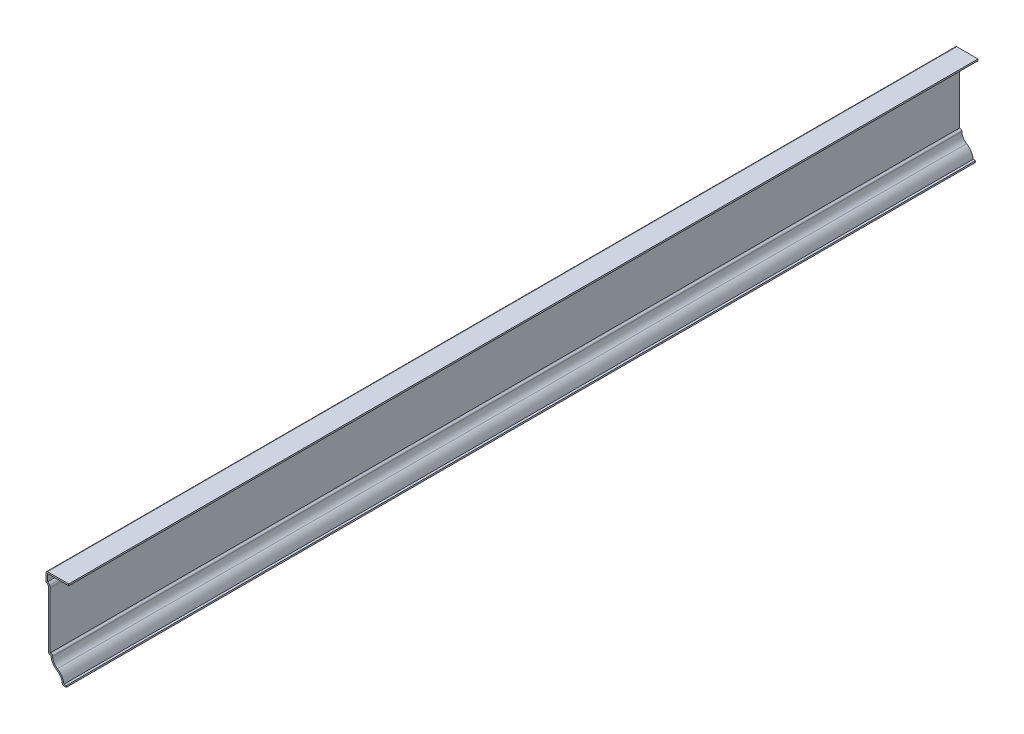
ISO-10303-21;
HEADER;
FILE_DESCRIPTION(('STEP AP214'),'2;1');
FILE_NAME('part.step','',(''),(''),'','','');
FILE_SCHEMA(('AUTOMOTIVE_DESIGN { 1 0 10303 214 1 1 1 1 }'));
ENDSEC;
DATA;
#1=APPLICATION_CONTEXT('core data for automotive mechanical design processes');
#2=APPLICATION_PROTOCOL_DEFINITION('international standard','automotive_design',2000,#1);
#3=PRODUCT_CONTEXT('',#1,'mechanical');
#4=PRODUCT('Part','Part','',(#3));
#5=PRODUCT_RELATED_PRODUCT_CATEGORY('part','',(#4));
#6=PRODUCT_DEFINITION_FORMATION('','',#4);
#7=PRODUCT_DEFINITION_CONTEXT('part definition',#1,'design');
#8=PRODUCT_DEFINITION('design','',#6,#7);
#9=PRODUCT_DEFINITION_SHAPE('','',#8);
#10=(LENGTH_UNIT() NAMED_UNIT(*) SI_UNIT(.MILLI.,.METRE.));
#11=(NAMED_UNIT(*) PLANE_ANGLE_UNIT() SI_UNIT($,.RADIAN.));
#12=(NAMED_UNIT(*) SI_UNIT($,.STERADIAN.) SOLID_ANGLE_UNIT());
#13=UNCERTAINTY_MEASURE_WITH_UNIT(LENGTH_MEASURE(1.E-05),#10,'distance_accuracy_value','');
#14=(GEOMETRIC_REPRESENTATION_CONTEXT(3) GLOBAL_UNCERTAINTY_ASSIGNED_CONTEXT((#13)) GLOBAL_UNIT_ASSIGNED_CONTEXT((#10,
#11,#12)) REPRESENTATION_CONTEXT('',''));
#15=CARTESIAN_POINT('',(0.,0.,0.));
#16=DIRECTION('',(0.,0.,1.));
#17=DIRECTION('',(1.,0.,0.));
#18=AXIS2_PLACEMENT_3D('',#15,#16,#17);
#19=CARTESIAN_POINT('',(-12.7,56.134,-571.5));
#20=DIRECTION('',(0.,-1.,0.));
#21=DIRECTION('',(1.,0.,0.));
#22=AXIS2_PLACEMENT_3D('',#19,#20,#21);
#23=PLANE('',#22);
#24=DIRECTION('',(1.,0.,0.));
#25=VECTOR('',#24,1.);
#26=CARTESIAN_POINT('',(-12.7,56.134,0.));
#27=LINE('',#26,#25);
#28=CARTESIAN_POINT('',(-11.684,56.134,0.));
#29=VERTEX_POINT('',#28);
#30=CARTESIAN_POINT('',(1.5875,56.134,0.));
#31=VERTEX_POINT('',#30);
#32=EDGE_CURVE('E286',#29,#31,#27,.T.);
#33=ORIENTED_EDGE('',*,*,#32,.F.);
#34=DIRECTION('',(0.,0.,1.));
#35=VECTOR('',#34,1.);
#36=CARTESIAN_POINT('',(-11.684,56.134,-571.5));
#37=LINE('',#36,#35);
#38=CARTESIAN_POINT('',(-11.684,56.134,-571.5));
#39=VERTEX_POINT('',#38);
#40=EDGE_CURVE('E224',#39,#29,#37,.T.);
#41=ORIENTED_EDGE('',*,*,#40,.F.);
#42=DIRECTION('',(1.,0.,0.));
#43=VECTOR('',#42,1.);
#44=CARTESIAN_POINT('',(-12.7,56.134,-571.5));
#45=LINE('',#44,#43);
#46=CARTESIAN_POINT('',(1.5875,56.134,-571.5));
#47=VERTEX_POINT('',#46);
#48=EDGE_CURVE('E204',#39,#47,#45,.T.);
#49=ORIENTED_EDGE('',*,*,#48,.T.);
#50=DIRECTION('',(0.,0.,1.));
#51=VECTOR('',#50,1.);
#52=CARTESIAN_POINT('',(1.5875,56.134,-571.5));
#53=LINE('',#52,#51);
#54=EDGE_CURVE('E213',#47,#31,#53,.T.);
#55=ORIENTED_EDGE('',*,*,#54,.T.);
#56=EDGE_LOOP('',(#33,#41,#49,#55));
#57=FACE_BOUND('',#56,.T.);
#58=ADVANCED_FACE('F41',(#57),#23,.T.);
#59=CARTESIAN_POINT('',(-11.684,50.8,-571.5));
#60=DIRECTION('',(1.,0.,0.));
#61=DIRECTION('',(0.,0.,-1.));
#62=AXIS2_PLACEMENT_3D('',#59,#60,#61);
#63=PLANE('',#62);
#64=DIRECTION('',(0.,1.,0.));
#65=VECTOR('',#64,1.);
#66=CARTESIAN_POINT('',(-11.684,50.8,0.));
#67=LINE('',#66,#65);
#68=CARTESIAN_POINT('',(-11.684,51.6095724331985,0.));
#69=VERTEX_POINT('',#68);
#70=EDGE_CURVE('E226',#69,#29,#67,.T.);
#71=ORIENTED_EDGE('',*,*,#70,.F.);
#72=DIRECTION('',(0.,0.,1.));
#73=VECTOR('',#72,1.);
#74=CARTESIAN_POINT('',(-11.684,51.6095724331985,-571.5));
#75=LINE('',#74,#73);
#76=CARTESIAN_POINT('',(-11.684,51.6095724331985,-571.5));
#77=VERTEX_POINT('',#76);
#78=EDGE_CURVE('E346',#77,#69,#75,.T.);
#79=ORIENTED_EDGE('',*,*,#78,.F.);
#80=DIRECTION('',(0.,1.,0.));
#81=VECTOR('',#80,1.);
#82=CARTESIAN_POINT('',(-11.684,50.8,-571.5));
#83=LINE('',#82,#81);
#84=EDGE_CURVE('E222',#77,#39,#83,.T.);
#85=ORIENTED_EDGE('',*,*,#84,.T.);
#86=ORIENTED_EDGE('',*,*,#40,.T.);
#87=EDGE_LOOP('',(#71,#79,#85,#86));
#88=FACE_BOUND('',#87,.T.);
#89=ADVANCED_FACE('F462',(#88),#63,.T.);
#90=CARTESIAN_POINT('',(-12.7,49.2125,-571.5));
#91=DIRECTION('',(0.,0.,1.));
#92=DIRECTION('',(1.,0.,0.));
#93=AXIS2_PLACEMENT_3D('',#90,#91,#92);
#94=CYLINDRICAL_SURFACE('',#93,2.6035);
#95=CARTESIAN_POINT('',(-12.7,49.2125,0.));
#96=DIRECTION('',(0.,0.,1.));
#97=DIRECTION('',(1.,0.,0.));
#98=AXIS2_PLACEMENT_3D('',#95,#96,#97);
#99=CIRCLE('',#98,2.6035);
#100=CARTESIAN_POINT('',(-10.0965,49.2125,0.));
#101=VERTEX_POINT('',#100);
#102=EDGE_CURVE('E230',#101,#69,#99,.T.);
#103=ORIENTED_EDGE('',*,*,#102,.F.);
#104=DIRECTION('',(0.,0.,1.));
#105=VECTOR('',#104,1.);
#106=CARTESIAN_POINT('',(-10.0965,49.2125,-571.5));
#107=LINE('',#106,#105);
#108=CARTESIAN_POINT('',(-10.0965,49.2125,-571.5));
#109=VERTEX_POINT('',#108);
#110=EDGE_CURVE('E349',#109,#101,#107,.T.);
#111=ORIENTED_EDGE('',*,*,#110,.F.);
#112=CARTESIAN_POINT('',(-12.7,49.2125,-571.5));
#113=DIRECTION('',(0.,0.,1.));
#114=DIRECTION('',(1.,0.,0.));
#115=AXIS2_PLACEMENT_3D('',#112,#113,#114);
#116=CIRCLE('',#115,2.6035);
#117=EDGE_CURVE('E280',#109,#77,#116,.T.);
#118=ORIENTED_EDGE('',*,*,#117,.T.);
#119=ORIENTED_EDGE('',*,*,#78,.T.);
#120=EDGE_LOOP('',(#103,#111,#118,#119));
#121=FACE_BOUND('',#120,.T.);
#122=ADVANCED_FACE('F538',(#121),#94,.T.);
#123=CARTESIAN_POINT('',(-10.0965,12.7,-571.5));
#124=DIRECTION('',(1.,0.,0.));
#125=DIRECTION('',(0.,0.,-1.));
#126=AXIS2_PLACEMENT_3D('',#123,#124,#125);
#127=PLANE('',#126);
#128=DIRECTION('',(0.,1.,0.));
#129=VECTOR('',#128,1.);
#130=CARTESIAN_POINT('',(-10.0965,12.7,0.));
#131=LINE('',#130,#129);
#132=CARTESIAN_POINT('',(-10.0965,13.716,0.));
#133=VERTEX_POINT('',#132);
#134=EDGE_CURVE('E336',#133,#101,#131,.T.);
#135=ORIENTED_EDGE('',*,*,#134,.F.);
#136=DIRECTION('',(0.,0.,1.));
#137=VECTOR('',#136,1.);
#138=CARTESIAN_POINT('',(-10.0965,13.716,-571.5));
#139=LINE('',#138,#137);
#140=CARTESIAN_POINT('',(-10.0965,13.716,-571.5));
#141=VERTEX_POINT('',#140);
#142=EDGE_CURVE('E352',#141,#133,#139,.T.);
#143=ORIENTED_EDGE('',*,*,#142,.F.);
#144=DIRECTION('',(0.,1.,0.));
#145=VECTOR('',#144,1.);
#146=CARTESIAN_POINT('',(-10.0965,12.7,-571.5));
#147=LINE('',#146,#145);
#148=EDGE_CURVE('E276',#141,#109,#147,.T.);
#149=ORIENTED_EDGE('',*,*,#148,.T.);
#150=ORIENTED_EDGE('',*,*,#110,.T.);
#151=EDGE_LOOP('',(#135,#143,#149,#150));
#152=FACE_BOUND('',#151,.T.);
#153=ADVANCED_FACE('F470',(#152),#127,.T.);
#154=CARTESIAN_POINT('',(-9.525,13.716,-571.5));
#155=DIRECTION('',(0.,1.,0.));
#156=DIRECTION('',(-1.,0.,0.));
#157=AXIS2_PLACEMENT_3D('',#154,#155,#156);
#158=PLANE('',#157);
#159=DIRECTION('',(-1.,0.,0.));
#160=VECTOR('',#159,1.);
#161=CARTESIAN_POINT('',(-9.525,13.716,0.));
#162=LINE('',#161,#160);
#163=CARTESIAN_POINT('',(-9.525,13.716,0.));
#164=VERTEX_POINT('',#163);
#165=EDGE_CURVE('E333',#164,#133,#162,.T.);
#166=ORIENTED_EDGE('',*,*,#165,.F.);
#167=DIRECTION('',(0.,0.,1.));
#168=VECTOR('',#167,1.);
#169=CARTESIAN_POINT('',(-9.525,13.716,-571.5));
#170=LINE('',#169,#168);
#171=CARTESIAN_POINT('',(-9.525,13.716,-571.5));
#172=VERTEX_POINT('',#171);
#173=EDGE_CURVE('E422',#164,#172,#170,.F.);
#174=ORIENTED_EDGE('',*,*,#173,.T.);
#175=DIRECTION('',(-1.,0.,0.));
#176=VECTOR('',#175,1.);
#177=CARTESIAN_POINT('',(-9.525,13.716,-571.5));
#178=LINE('',#177,#176);
#179=EDGE_CURVE('E273',#172,#141,#178,.T.);
#180=ORIENTED_EDGE('',*,*,#179,.T.);
#181=ORIENTED_EDGE('',*,*,#142,.T.);
#182=EDGE_LOOP('',(#166,#174,#180,#181));
#183=FACE_BOUND('',#182,.T.);
#184=ADVANCED_FACE('F473',(#183),#158,.T.);
#185=CARTESIAN_POINT('',(-2.38125,12.7,-571.5));
#186=DIRECTION('',(0.,0.,1.));
#187=DIRECTION('',(1.,0.,0.));
#188=AXIS2_PLACEMENT_3D('',#185,#186,#187);
#189=CYLINDRICAL_SURFACE('',#188,6.12775);
#190=CARTESIAN_POINT('',(-2.38125,12.7,-571.5));
#191=DIRECTION('',(0.,0.,1.));
#192=DIRECTION('',(1.,0.,0.));
#193=AXIS2_PLACEMENT_3D('',#190,#191,#192);
#194=CIRCLE('',#193,6.12775);
#195=CARTESIAN_POINT('',(-5.56331602373887,7.46322848664688,-571.5));
#196=VERTEX_POINT('',#195);
#197=CARTESIAN_POINT('',(-8.509,12.7,-571.5));
#198=VERTEX_POINT('',#197);
#199=EDGE_CURVE('E269',#196,#198,#194,.F.);
#200=ORIENTED_EDGE('',*,*,#199,.T.);
#201=DIRECTION('',(0.,0.,1.));
#202=VECTOR('',#201,1.);
#203=CARTESIAN_POINT('',(-8.509,12.7,-571.5));
#204=LINE('',#203,#202);
#205=CARTESIAN_POINT('',(-8.509,12.7,0.));
#206=VERTEX_POINT('',#205);
#207=EDGE_CURVE('E418',#198,#206,#204,.T.);
#208=ORIENTED_EDGE('',*,*,#207,.T.);
#209=CARTESIAN_POINT('',(-2.38125,12.7,0.));
#210=DIRECTION('',(0.,0.,1.));
#211=DIRECTION('',(1.,0.,0.));
#212=AXIS2_PLACEMENT_3D('',#209,#210,#211);
#213=CIRCLE('',#212,6.12775);
#214=CARTESIAN_POINT('',(-5.56331602373887,7.46322848664688,0.));
#215=VERTEX_POINT('',#214);
#216=EDGE_CURVE('E329',#215,#206,#213,.F.);
#217=ORIENTED_EDGE('',*,*,#216,.F.);
#218=DIRECTION('',(0.,0.,1.));
#219=VECTOR('',#218,1.);
#220=CARTESIAN_POINT('',(-5.56331602373887,7.46322848664688,-571.5));
#221=LINE('',#220,#219);
#222=EDGE_CURVE('E356',#196,#215,#221,.T.);
#223=ORIENTED_EDGE('',*,*,#222,.F.);
#224=EDGE_LOOP('',(#200,#208,#217,#223));
#225=FACE_BOUND('',#224,.T.);
#226=ADVANCED_FACE('F482',(#225),#189,.F.);
#227=CARTESIAN_POINT('',(-10.0982638888889,0.,-571.5));
#228=DIRECTION('',(0.,0.,1.));
#229=DIRECTION('',(1.,0.,0.));
#230=AXIS2_PLACEMENT_3D('',#227,#228,#229);
#231=CYLINDRICAL_SURFACE('',#230,8.73301388888888);
#232=CARTESIAN_POINT('',(-10.0982638888889,0.,0.));
#233=DIRECTION('',(0.,0.,1.));
#234=DIRECTION('',(1.,0.,0.));
#235=AXIS2_PLACEMENT_3D('',#232,#233,#234);
#236=CIRCLE('',#235,8.73301388888888);
#237=CARTESIAN_POINT('',(-1.42455213534726,1.016,0.));
#238=VERTEX_POINT('',#237);
#239=EDGE_CURVE('E325',#238,#215,#236,.T.);
#240=ORIENTED_EDGE('',*,*,#239,.F.);
#241=DIRECTION('',(0.,0.,1.));
#242=VECTOR('',#241,1.);
#243=CARTESIAN_POINT('',(-1.42455213534726,1.016,-571.5));
#244=LINE('',#243,#242);
#245=CARTESIAN_POINT('',(-1.42455213534726,1.016,-571.5));
#246=VERTEX_POINT('',#245);
#247=EDGE_CURVE('E359',#246,#238,#244,.T.);
#248=ORIENTED_EDGE('',*,*,#247,.F.);
#249=CARTESIAN_POINT('',(-10.0982638888889,0.,-571.5));
#250=DIRECTION('',(0.,0.,1.));
#251=DIRECTION('',(1.,0.,0.));
#252=AXIS2_PLACEMENT_3D('',#249,#250,#251);
#253=CIRCLE('',#252,8.73301388888888);
#254=EDGE_CURVE('E265',#246,#196,#253,.T.);
#255=ORIENTED_EDGE('',*,*,#254,.T.);
#256=ORIENTED_EDGE('',*,*,#222,.T.);
#257=EDGE_LOOP('',(#240,#248,#255,#256));
#258=FACE_BOUND('',#257,.T.);
#259=ADVANCED_FACE('F487',(#258),#231,.T.);
#260=CARTESIAN_POINT('',(0.,1.016,-571.5));
#261=DIRECTION('',(0.,1.,0.));
#262=DIRECTION('',(-1.,0.,0.));
#263=AXIS2_PLACEMENT_3D('',#260,#261,#262);
#264=PLANE('',#263);
#265=DIRECTION('',(-1.,0.,0.));
#266=VECTOR('',#265,1.);
#267=CARTESIAN_POINT('',(0.,1.016,0.));
#268=LINE('',#267,#266);
#269=CARTESIAN_POINT('',(0.,1.016,0.));
#270=VERTEX_POINT('',#269);
#271=EDGE_CURVE('E321',#270,#238,#268,.T.);
#272=ORIENTED_EDGE('',*,*,#271,.F.);
#273=DIRECTION('',(0.,0.,1.));
#274=VECTOR('',#273,1.);
#275=CARTESIAN_POINT('',(0.,1.016,-571.5));
#276=LINE('',#275,#274);
#277=CARTESIAN_POINT('',(0.,1.016,-571.5));
#278=VERTEX_POINT('',#277);
#279=EDGE_CURVE('E362',#278,#270,#276,.T.);
#280=ORIENTED_EDGE('',*,*,#279,.F.);
#281=DIRECTION('',(-1.,0.,0.));
#282=VECTOR('',#281,1.);
#283=CARTESIAN_POINT('',(0.,1.016,-571.5));
#284=LINE('',#283,#282);
#285=EDGE_CURVE('E261',#278,#246,#284,.T.);
#286=ORIENTED_EDGE('',*,*,#285,.T.);
#287=ORIENTED_EDGE('',*,*,#247,.T.);
#288=EDGE_LOOP('',(#272,#280,#286,#287));
#289=FACE_BOUND('',#288,.T.);
#290=ADVANCED_FACE('F491',(#289),#264,.T.);
#291=CARTESIAN_POINT('',(0.,1.016,-571.5));
#292=DIRECTION('',(-1.,0.,0.));
#293=DIRECTION('',(0.,-1.,0.));
#294=AXIS2_PLACEMENT_3D('',#291,#292,#293);
#295=PLANE('',#294);
#296=DIRECTION('',(0.,-1.,0.));
#297=VECTOR('',#296,1.);
#298=CARTESIAN_POINT('',(0.,1.016,0.));
#299=LINE('',#298,#297);
#300=CARTESIAN_POINT('',(0.,0.,0.));
#301=VERTEX_POINT('',#300);
#302=EDGE_CURVE('E318',#270,#301,#299,.T.);
#303=ORIENTED_EDGE('',*,*,#302,.T.);
#304=DIRECTION('',(0.,0.,1.));
#305=VECTOR('',#304,1.);
#306=CARTESIAN_POINT('',(0.,0.,-571.5));
#307=LINE('',#306,#305);
#308=CARTESIAN_POINT('',(0.,0.,-571.5));
#309=VERTEX_POINT('',#308);
#310=EDGE_CURVE('E365',#309,#301,#307,.T.);
#311=ORIENTED_EDGE('',*,*,#310,.F.);
#312=DIRECTION('',(0.,-1.,0.));
#313=VECTOR('',#312,1.);
#314=CARTESIAN_POINT('',(0.,1.016,-571.5));
#315=LINE('',#314,#313);
#316=EDGE_CURVE('E258',#278,#309,#315,.T.);
#317=ORIENTED_EDGE('',*,*,#316,.F.);
#318=ORIENTED_EDGE('',*,*,#279,.T.);
#319=EDGE_LOOP('',(#303,#311,#317,#318));
#320=FACE_BOUND('',#319,.T.);
#321=ADVANCED_FACE('F495',(#320),#295,.F.);
#322=CARTESIAN_POINT('',(0.,0.,-571.5));
#323=DIRECTION('',(0.,1.,0.));
#324=DIRECTION('',(-1.,0.,0.));
#325=AXIS2_PLACEMENT_3D('',#322,#323,#324);
#326=PLANE('',#325);
#327=DIRECTION('',(-1.,0.,0.));
#328=VECTOR('',#327,1.);
#329=CARTESIAN_POINT('',(0.,0.,0.));
#330=LINE('',#329,#328);
#331=CARTESIAN_POINT('',(-1.42455213534726,0.,0.));
#332=VERTEX_POINT('',#331);
#333=EDGE_CURVE('E314',#301,#332,#330,.T.);
#334=ORIENTED_EDGE('',*,*,#333,.T.);
#335=DIRECTION('',(0.,0.,1.));
#336=VECTOR('',#335,1.);
#337=CARTESIAN_POINT('',(-1.42455213534726,0.,-571.5));
#338=LINE('',#337,#336);
#339=CARTESIAN_POINT('',(-1.42455213534726,0.,-571.5));
#340=VERTEX_POINT('',#339);
#341=EDGE_CURVE('E401',#332,#340,#338,.F.);
#342=ORIENTED_EDGE('',*,*,#341,.T.);
#343=DIRECTION('',(-1.,0.,0.));
#344=VECTOR('',#343,1.);
#345=CARTESIAN_POINT('',(0.,0.,-571.5));
#346=LINE('',#345,#344);
#347=EDGE_CURVE('E255',#309,#340,#346,.T.);
#348=ORIENTED_EDGE('',*,*,#347,.F.);
#349=ORIENTED_EDGE('',*,*,#310,.T.);
#350=EDGE_LOOP('',(#334,#342,#348,#349));
#351=FACE_BOUND('',#350,.T.);
#352=ADVANCED_FACE('F637',(#351),#326,.F.);
#353=CARTESIAN_POINT('',(-10.0982638888889,0.,-571.5));
#354=DIRECTION('',(0.,0.,1.));
#355=DIRECTION('',(1.,0.,0.));
#356=AXIS2_PLACEMENT_3D('',#353,#354,#355);
#357=CYLINDRICAL_SURFACE('',#356,7.71701388888888);
#358=CARTESIAN_POINT('',(-10.0982638888889,0.,-571.5));
#359=DIRECTION('',(0.,0.,1.));
#360=DIRECTION('',(1.,0.,0.));
#361=AXIS2_PLACEMENT_3D('',#358,#359,#360);
#362=CIRCLE('',#361,7.71701388888888);
#363=CARTESIAN_POINT('',(-2.4336529170156,0.897798424560695,-571.5));
#364=VERTEX_POINT('',#363);
#365=CARTESIAN_POINT('',(-6.09091246290801,6.59495548961424,-571.5));
#366=VERTEX_POINT('',#365);
#367=EDGE_CURVE('E252',#364,#366,#362,.T.);
#368=ORIENTED_EDGE('',*,*,#367,.F.);
#369=DIRECTION('',(0.,0.,1.));
#370=VECTOR('',#369,1.);
#371=CARTESIAN_POINT('',(-2.4336529170156,0.897798424560695,-571.5));
#372=LINE('',#371,#370);
#373=CARTESIAN_POINT('',(-2.4336529170156,0.897798424560695,0.));
#374=VERTEX_POINT('',#373);
#375=EDGE_CURVE('E345',#364,#374,#372,.T.);
#376=ORIENTED_EDGE('',*,*,#375,.T.);
#377=CARTESIAN_POINT('',(-10.0982638888889,0.,0.));
#378=DIRECTION('',(0.,0.,1.));
#379=DIRECTION('',(1.,0.,0.));
#380=AXIS2_PLACEMENT_3D('',#377,#378,#379);
#381=CIRCLE('',#380,7.71701388888888);
#382=CARTESIAN_POINT('',(-6.09091246290801,6.59495548961424,0.));
#383=VERTEX_POINT('',#382);
#384=EDGE_CURVE('E311',#374,#383,#381,.T.);
#385=ORIENTED_EDGE('',*,*,#384,.T.);
#386=DIRECTION('',(0.,0.,1.));
#387=VECTOR('',#386,1.);
#388=CARTESIAN_POINT('',(-6.09091246290801,6.59495548961424,-571.5));
#389=LINE('',#388,#387);
#390=EDGE_CURVE('E369',#366,#383,#389,.T.);
#391=ORIENTED_EDGE('',*,*,#390,.F.);
#392=EDGE_LOOP('',(#368,#376,#385,#391));
#393=FACE_BOUND('',#392,.T.);
#394=ADVANCED_FACE('F505',(#393),#357,.F.);
#395=CARTESIAN_POINT('',(-2.38125,12.7,-571.5));
#396=DIRECTION('',(0.,0.,1.));
#397=DIRECTION('',(1.,0.,0.));
#398=AXIS2_PLACEMENT_3D('',#395,#396,#397);
#399=CYLINDRICAL_SURFACE('',#398,7.14375);
#400=CARTESIAN_POINT('',(-2.38125,12.7,0.));
#401=DIRECTION('',(0.,0.,-1.));
#402=DIRECTION('',(-1.,0.,0.));
#403=AXIS2_PLACEMENT_3D('',#400,#401,#402);
#404=CIRCLE('',#403,7.14375);
#405=CARTESIAN_POINT('',(-9.525,12.7,0.));
#406=VERTEX_POINT('',#405);
#407=EDGE_CURVE('E308',#383,#406,#404,.T.);
#408=ORIENTED_EDGE('',*,*,#407,.T.);
#409=DIRECTION('',(0.,0.,1.));
#410=VECTOR('',#409,1.);
#411=CARTESIAN_POINT('',(-9.525,12.7,-571.5));
#412=LINE('',#411,#410);
#413=CARTESIAN_POINT('',(-9.525,12.7,-571.5));
#414=VERTEX_POINT('',#413);
#415=EDGE_CURVE('E373',#414,#406,#412,.T.);
#416=ORIENTED_EDGE('',*,*,#415,.F.);
#417=CARTESIAN_POINT('',(-2.38125,12.7,-571.5));
#418=DIRECTION('',(0.,0.,-1.));
#419=DIRECTION('',(-1.,0.,0.));
#420=AXIS2_PLACEMENT_3D('',#417,#418,#419);
#421=CIRCLE('',#420,7.14375);
#422=EDGE_CURVE('E249',#366,#414,#421,.T.);
#423=ORIENTED_EDGE('',*,*,#422,.F.);
#424=ORIENTED_EDGE('',*,*,#390,.T.);
#425=EDGE_LOOP('',(#408,#416,#423,#424));
#426=FACE_BOUND('',#425,.T.);
#427=ADVANCED_FACE('F512',(#426),#399,.T.);
#428=CARTESIAN_POINT('',(-9.525,12.7,-571.5));
#429=DIRECTION('',(0.,1.,0.));
#430=DIRECTION('',(-1.,0.,0.));
#431=AXIS2_PLACEMENT_3D('',#428,#429,#430);
#432=PLANE('',#431);
#433=DIRECTION('',(-1.,0.,0.));
#434=VECTOR('',#433,1.);
#435=CARTESIAN_POINT('',(-9.525,12.7,0.));
#436=LINE('',#435,#434);
#437=CARTESIAN_POINT('',(-10.0965,12.7,0.));
#438=VERTEX_POINT('',#437);
#439=EDGE_CURVE('E304',#406,#438,#436,.T.);
#440=ORIENTED_EDGE('',*,*,#439,.T.);
#441=DIRECTION('',(0.,0.,1.));
#442=VECTOR('',#441,1.);
#443=CARTESIAN_POINT('',(-10.0965,12.7,-571.5));
#444=LINE('',#443,#442);
#445=CARTESIAN_POINT('',(-10.0965,12.7,-571.5));
#446=VERTEX_POINT('',#445);
#447=EDGE_CURVE('E429',#438,#446,#444,.F.);
#448=ORIENTED_EDGE('',*,*,#447,.T.);
#449=DIRECTION('',(-1.,0.,0.));
#450=VECTOR('',#449,1.);
#451=CARTESIAN_POINT('',(-9.525,12.7,-571.5));
#452=LINE('',#451,#450);
#453=EDGE_CURVE('E245',#414,#446,#452,.T.);
#454=ORIENTED_EDGE('',*,*,#453,.F.);
#455=ORIENTED_EDGE('',*,*,#415,.T.);
#456=EDGE_LOOP('',(#440,#448,#454,#455));
#457=FACE_BOUND('',#456,.T.);
#458=ADVANCED_FACE('F516',(#457),#432,.F.);
#459=CARTESIAN_POINT('',(-11.1125,12.7,-571.5));
#460=DIRECTION('',(1.,0.,0.));
#461=DIRECTION('',(0.,0.,-1.));
#462=AXIS2_PLACEMENT_3D('',#459,#460,#461);
#463=PLANE('',#462);
#464=DIRECTION('',(0.,1.,0.));
#465=VECTOR('',#464,1.);
#466=CARTESIAN_POINT('',(-11.1125,12.7,-571.5));
#467=LINE('',#466,#465);
#468=CARTESIAN_POINT('',(-11.1125,13.716,-571.5));
#469=VERTEX_POINT('',#468);
#470=CARTESIAN_POINT('',(-11.1125,49.2125,-571.5));
#471=VERTEX_POINT('',#470);
#472=EDGE_CURVE('E242',#469,#471,#467,.T.);
#473=ORIENTED_EDGE('',*,*,#472,.F.);
#474=DIRECTION('',(0.,0.,1.));
#475=VECTOR('',#474,1.);
#476=CARTESIAN_POINT('',(-11.1125,13.716,-571.5));
#477=LINE('',#476,#475);
#478=CARTESIAN_POINT('',(-11.1125,13.716,0.));
#479=VERTEX_POINT('',#478);
#480=EDGE_CURVE('E425',#469,#479,#477,.T.);
#481=ORIENTED_EDGE('',*,*,#480,.T.);
#482=DIRECTION('',(0.,1.,0.));
#483=VECTOR('',#482,1.);
#484=CARTESIAN_POINT('',(-11.1125,12.7,0.));
#485=LINE('',#484,#483);
#486=CARTESIAN_POINT('',(-11.1125,49.2125,0.));
#487=VERTEX_POINT('',#486);
#488=EDGE_CURVE('E301',#479,#487,#485,.T.);
#489=ORIENTED_EDGE('',*,*,#488,.T.);
#490=DIRECTION('',(0.,0.,1.));
#491=VECTOR('',#490,1.);
#492=CARTESIAN_POINT('',(-11.1125,49.2125,-571.5));
#493=LINE('',#492,#491);
#494=EDGE_CURVE('E377',#471,#487,#493,.T.);
#495=ORIENTED_EDGE('',*,*,#494,.F.);
#496=EDGE_LOOP('',(#473,#481,#489,#495));
#497=FACE_BOUND('',#496,.T.);
#498=ADVANCED_FACE('F524',(#497),#463,.F.);
#499=CARTESIAN_POINT('',(-12.7,49.2125,-571.5));
#500=DIRECTION('',(0.,0.,1.));
#501=DIRECTION('',(1.,0.,0.));
#502=AXIS2_PLACEMENT_3D('',#499,#500,#501);
#503=CYLINDRICAL_SURFACE('',#502,1.5875);
#504=CARTESIAN_POINT('',(-12.7,49.2125,0.));
#505=DIRECTION('',(0.,0.,1.));
#506=DIRECTION('',(1.,0.,0.));
#507=AXIS2_PLACEMENT_3D('',#504,#505,#506);
#508=CIRCLE('',#507,1.5875);
#509=CARTESIAN_POINT('',(-12.0804878048781,50.6741295324381,0.));
#510=VERTEX_POINT('',#509);
#511=EDGE_CURVE('E297',#487,#510,#508,.T.);
#512=ORIENTED_EDGE('',*,*,#511,.T.);
#513=DIRECTION('',(0.,0.,1.));
#514=VECTOR('',#513,1.);
#515=CARTESIAN_POINT('',(-12.0804878048781,50.6741295324381,-571.5));
#516=LINE('',#515,#514);
#517=CARTESIAN_POINT('',(-12.0804878048781,50.6741295324381,-571.5));
#518=VERTEX_POINT('',#517);
#519=EDGE_CURVE('E50',#510,#518,#516,.F.);
#520=ORIENTED_EDGE('',*,*,#519,.T.);
#521=CARTESIAN_POINT('',(-12.7,49.2125,-571.5));
#522=DIRECTION('',(0.,0.,1.));
#523=DIRECTION('',(1.,0.,0.));
#524=AXIS2_PLACEMENT_3D('',#521,#522,#523);
#525=CIRCLE('',#524,1.5875);
#526=EDGE_CURVE('E238',#471,#518,#525,.T.);
#527=ORIENTED_EDGE('',*,*,#526,.F.);
#528=ORIENTED_EDGE('',*,*,#494,.T.);
#529=EDGE_LOOP('',(#512,#520,#527,#528));
#530=FACE_BOUND('',#529,.T.);
#531=ADVANCED_FACE('F441',(#530),#503,.F.);
#532=CARTESIAN_POINT('',(-12.7,50.8,-571.5));
#533=DIRECTION('',(1.,0.,0.));
#534=DIRECTION('',(0.,0.,-1.));
#535=AXIS2_PLACEMENT_3D('',#532,#533,#534);
#536=PLANE('',#535);
#537=DIRECTION('',(0.,1.,0.));
#538=VECTOR('',#537,1.);
#539=CARTESIAN_POINT('',(-12.7,50.8,-571.5));
#540=LINE('',#539,#538);
#541=CARTESIAN_POINT('',(-12.7,51.6095724331985,-571.5));
#542=VERTEX_POINT('',#541);
#543=CARTESIAN_POINT('',(-12.7,56.134,-571.5));
#544=VERTEX_POINT('',#543);
#545=EDGE_CURVE('E235',#542,#544,#540,.T.);
#546=ORIENTED_EDGE('',*,*,#545,.F.);
#547=DIRECTION('',(0.,0.,1.));
#548=VECTOR('',#547,1.);
#549=CARTESIAN_POINT('',(-12.7,51.6095724331985,-571.5));
#550=LINE('',#549,#548);
#551=CARTESIAN_POINT('',(-12.7,51.6095724331985,0.));
#552=VERTEX_POINT('',#551);
#553=EDGE_CURVE('E434',#542,#552,#550,.T.);
#554=ORIENTED_EDGE('',*,*,#553,.T.);
#555=DIRECTION('',(0.,1.,0.));
#556=VECTOR('',#555,1.);
#557=CARTESIAN_POINT('',(-12.7,50.8,0.));
#558=LINE('',#557,#556);
#559=CARTESIAN_POINT('',(-12.7,56.134,0.));
#560=VERTEX_POINT('',#559);
#561=EDGE_CURVE('E294',#552,#560,#558,.T.);
#562=ORIENTED_EDGE('',*,*,#561,.T.);
#563=DIRECTION('',(0.,0.,1.));
#564=VECTOR('',#563,1.);
#565=CARTESIAN_POINT('',(-12.7,56.134,-571.5));
#566=LINE('',#565,#564);
#567=EDGE_CURVE('E65',#560,#544,#566,.F.);
#568=ORIENTED_EDGE('',*,*,#567,.T.);
#569=EDGE_LOOP('',(#546,#554,#562,#568));
#570=FACE_BOUND('',#569,.T.);
#571=ADVANCED_FACE('F450',(#570),#536,.F.);
#572=CARTESIAN_POINT('',(-12.7,57.15,-571.5));
#573=DIRECTION('',(0.,-1.,0.));
#574=DIRECTION('',(1.,0.,0.));
#575=AXIS2_PLACEMENT_3D('',#572,#573,#574);
#576=PLANE('',#575);
#577=DIRECTION('',(1.,0.,0.));
#578=VECTOR('',#577,1.);
#579=CARTESIAN_POINT('',(-12.7,57.15,-571.5));
#580=LINE('',#579,#578);
#581=CARTESIAN_POINT('',(-11.684,57.15,-571.5));
#582=VERTEX_POINT('',#581);
#583=CARTESIAN_POINT('',(1.5875,57.15,-571.5));
#584=VERTEX_POINT('',#583);
#585=EDGE_CURVE('E206',#582,#584,#580,.T.);
#586=ORIENTED_EDGE('',*,*,#585,.F.);
#587=DIRECTION('',(0.,0.,1.));
#588=VECTOR('',#587,1.);
#589=CARTESIAN_POINT('',(-11.684,57.15,-571.5));
#590=LINE('',#589,#588);
#591=CARTESIAN_POINT('',(-11.684,57.15,0.));
#592=VERTEX_POINT('',#591);
#593=EDGE_CURVE('E11',#582,#592,#590,.T.);
#594=ORIENTED_EDGE('',*,*,#593,.T.);
#595=DIRECTION('',(1.,0.,0.));
#596=VECTOR('',#595,1.);
#597=CARTESIAN_POINT('',(-12.7,57.15,0.));
#598=LINE('',#597,#596);
#599=CARTESIAN_POINT('',(1.5875,57.15,0.));
#600=VERTEX_POINT('',#599);
#601=EDGE_CURVE('E291',#592,#600,#598,.T.);
#602=ORIENTED_EDGE('',*,*,#601,.T.);
#603=DIRECTION('',(0.,0.,1.));
#604=VECTOR('',#603,1.);
#605=CARTESIAN_POINT('',(1.5875,57.15,-571.5));
#606=LINE('',#605,#604);
#607=EDGE_CURVE('E221',#584,#600,#606,.T.);
#608=ORIENTED_EDGE('',*,*,#607,.F.);
#609=EDGE_LOOP('',(#586,#594,#602,#608));
#610=FACE_BOUND('',#609,.T.);
#611=ADVANCED_FACE('F458',(#610),#576,.F.);
#612=CARTESIAN_POINT('',(1.5875,57.15,-571.5));
#613=DIRECTION('',(-1.,0.,0.));
#614=DIRECTION('',(0.,0.,1.));
#615=AXIS2_PLACEMENT_3D('',#612,#613,#614);
#616=PLANE('',#615);
#617=DIRECTION('',(0.,-1.,0.));
#618=VECTOR('',#617,1.);
#619=CARTESIAN_POINT('',(1.5875,57.15,0.));
#620=LINE('',#619,#618);
#621=EDGE_CURVE('E216',#600,#31,#620,.T.);
#622=ORIENTED_EDGE('',*,*,#621,.T.);
#623=ORIENTED_EDGE('',*,*,#54,.F.);
#624=DIRECTION('',(0.,-1.,0.));
#625=VECTOR('',#624,1.);
#626=CARTESIAN_POINT('',(1.5875,57.15,-571.5));
#627=LINE('',#626,#625);
#628=EDGE_CURVE('E198',#584,#47,#627,.T.);
#629=ORIENTED_EDGE('',*,*,#628,.F.);
#630=ORIENTED_EDGE('',*,*,#607,.T.);
#631=EDGE_LOOP('',(#622,#623,#629,#630));
#632=FACE_BOUND('',#631,.T.);
#633=ADVANCED_FACE('F214',(#632),#616,.F.);
#634=CARTESIAN_POINT('',(-12.7,49.2125,-571.5));
#635=DIRECTION('',(0.,0.,1.));
#636=DIRECTION('',(1.,0.,0.));
#637=AXIS2_PLACEMENT_3D('',#634,#635,#636);
#638=PLANE('',#637);
#639=ORIENTED_EDGE('',*,*,#347,.T.);
#640=CARTESIAN_POINT('',(-1.42455213534726,1.016,-571.5));
#641=DIRECTION('',(0.,0.,1.));
#642=DIRECTION('',(1.,0.,0.));
#643=AXIS2_PLACEMENT_3D('',#640,#641,#642);
#644=CIRCLE('',#643,1.016);
#645=EDGE_CURVE('E415',#340,#364,#644,.F.);
#646=ORIENTED_EDGE('',*,*,#645,.T.);
#647=ORIENTED_EDGE('',*,*,#367,.T.);
#648=ORIENTED_EDGE('',*,*,#422,.T.);
#649=ORIENTED_EDGE('',*,*,#453,.T.);
#650=CARTESIAN_POINT('',(-10.0965,13.716,-571.5));
#651=DIRECTION('',(0.,0.,1.));
#652=DIRECTION('',(1.,0.,0.));
#653=AXIS2_PLACEMENT_3D('',#650,#651,#652);
#654=CIRCLE('',#653,1.016);
#655=EDGE_CURVE('E409',#446,#469,#654,.F.);
#656=ORIENTED_EDGE('',*,*,#655,.T.);
#657=ORIENTED_EDGE('',*,*,#472,.T.);
#658=ORIENTED_EDGE('',*,*,#526,.T.);
#659=CARTESIAN_POINT('',(-11.684,51.6095724331985,-571.5));
#660=DIRECTION('',(0.,0.,1.));
#661=DIRECTION('',(1.,0.,0.));
#662=AXIS2_PLACEMENT_3D('',#659,#660,#661);
#663=CIRCLE('',#662,1.016);
#664=EDGE_CURVE('E406',#518,#542,#663,.F.);
#665=ORIENTED_EDGE('',*,*,#664,.T.);
#666=ORIENTED_EDGE('',*,*,#545,.T.);
#667=CARTESIAN_POINT('',(-11.684,56.134,-571.5));
#668=DIRECTION('',(0.,0.,1.));
#669=DIRECTION('',(1.,0.,0.));
#670=AXIS2_PLACEMENT_3D('',#667,#668,#669);
#671=CIRCLE('',#670,1.016);
#672=EDGE_CURVE('E57',#544,#582,#671,.F.);
#673=ORIENTED_EDGE('',*,*,#672,.T.);
#674=ORIENTED_EDGE('',*,*,#585,.T.);
#675=ORIENTED_EDGE('',*,*,#628,.T.);
#676=ORIENTED_EDGE('',*,*,#48,.F.);
#677=ORIENTED_EDGE('',*,*,#84,.F.);
#678=ORIENTED_EDGE('',*,*,#117,.F.);
#679=ORIENTED_EDGE('',*,*,#148,.F.);
#680=ORIENTED_EDGE('',*,*,#179,.F.);
#681=CARTESIAN_POINT('',(-9.525,12.7,-571.5));
#682=DIRECTION('',(0.,0.,1.));
#683=DIRECTION('',(1.,0.,0.));
#684=AXIS2_PLACEMENT_3D('',#681,#682,#683);
#685=CIRCLE('',#684,1.016);
#686=EDGE_CURVE('E412',#172,#198,#685,.F.);
#687=ORIENTED_EDGE('',*,*,#686,.T.);
#688=ORIENTED_EDGE('',*,*,#199,.F.);
#689=ORIENTED_EDGE('',*,*,#254,.F.);
#690=ORIENTED_EDGE('',*,*,#285,.F.);
#691=ORIENTED_EDGE('',*,*,#316,.T.);
#692=EDGE_LOOP('',(#639,#646,#647,#648,#649,#656,#657,#658,#665,#666,#673,#674,#675,#676,#677,
#678,#679,#680,#687,#688,#689,#690,#691));
#693=FACE_BOUND('',#692,.T.);
#694=ADVANCED_FACE('F201',(#693),#638,.F.);
#695=CARTESIAN_POINT('',(-12.7,49.2125,0.));
#696=DIRECTION('',(0.,0.,1.));
#697=DIRECTION('',(1.,0.,0.));
#698=AXIS2_PLACEMENT_3D('',#695,#696,#697);
#699=PLANE('',#698);
#700=ORIENTED_EDGE('',*,*,#384,.F.);
#701=CARTESIAN_POINT('',(-1.42455213534726,1.016,0.));
#702=DIRECTION('',(0.,0.,1.));
#703=DIRECTION('',(1.,0.,0.));
#704=AXIS2_PLACEMENT_3D('',#701,#702,#703);
#705=CIRCLE('',#704,1.016);
#706=EDGE_CURVE('E398',#374,#332,#705,.T.);
#707=ORIENTED_EDGE('',*,*,#706,.T.);
#708=ORIENTED_EDGE('',*,*,#333,.F.);
#709=ORIENTED_EDGE('',*,*,#302,.F.);
#710=ORIENTED_EDGE('',*,*,#271,.T.);
#711=ORIENTED_EDGE('',*,*,#239,.T.);
#712=ORIENTED_EDGE('',*,*,#216,.T.);
#713=CARTESIAN_POINT('',(-9.525,12.7,0.));
#714=DIRECTION('',(0.,0.,1.));
#715=DIRECTION('',(1.,0.,0.));
#716=AXIS2_PLACEMENT_3D('',#713,#714,#715);
#717=CIRCLE('',#716,1.016);
#718=EDGE_CURVE('E395',#206,#164,#717,.T.);
#719=ORIENTED_EDGE('',*,*,#718,.T.);
#720=ORIENTED_EDGE('',*,*,#165,.T.);
#721=ORIENTED_EDGE('',*,*,#134,.T.);
#722=ORIENTED_EDGE('',*,*,#102,.T.);
#723=ORIENTED_EDGE('',*,*,#70,.T.);
#724=ORIENTED_EDGE('',*,*,#32,.T.);
#725=ORIENTED_EDGE('',*,*,#621,.F.);
#726=ORIENTED_EDGE('',*,*,#601,.F.);
#727=CARTESIAN_POINT('',(-11.684,56.134,0.));
#728=DIRECTION('',(0.,0.,1.));
#729=DIRECTION('',(1.,0.,0.));
#730=AXIS2_PLACEMENT_3D('',#727,#728,#729);
#731=CIRCLE('',#730,1.016);
#732=EDGE_CURVE('E386',#592,#560,#731,.T.);
#733=ORIENTED_EDGE('',*,*,#732,.T.);
#734=ORIENTED_EDGE('',*,*,#561,.F.);
#735=CARTESIAN_POINT('',(-11.684,51.6095724331985,0.));
#736=DIRECTION('',(0.,0.,1.));
#737=DIRECTION('',(1.,0.,0.));
#738=AXIS2_PLACEMENT_3D('',#735,#736,#737);
#739=CIRCLE('',#738,1.016);
#740=EDGE_CURVE('E389',#552,#510,#739,.T.);
#741=ORIENTED_EDGE('',*,*,#740,.T.);
#742=ORIENTED_EDGE('',*,*,#511,.F.);
#743=ORIENTED_EDGE('',*,*,#488,.F.);
#744=CARTESIAN_POINT('',(-10.0965,13.716,0.));
#745=DIRECTION('',(0.,0.,1.));
#746=DIRECTION('',(1.,0.,0.));
#747=AXIS2_PLACEMENT_3D('',#744,#745,#746);
#748=CIRCLE('',#747,1.016);
#749=EDGE_CURVE('E392',#479,#438,#748,.T.);
#750=ORIENTED_EDGE('',*,*,#749,.T.);
#751=ORIENTED_EDGE('',*,*,#439,.F.);
#752=ORIENTED_EDGE('',*,*,#407,.F.);
#753=EDGE_LOOP('',(#700,#707,#708,#709,#710,#711,#712,#719,#720,#721,#722,#723,#724,#725,#726,
#733,#734,#741,#742,#743,#750,#751,#752));
#754=FACE_BOUND('',#753,.T.);
#755=ADVANCED_FACE('F453',(#754),#699,.T.);
#756=CARTESIAN_POINT('',(-1.42455213534726,1.016,-571.5));
#757=DIRECTION('',(0.,0.,1.));
#758=DIRECTION('',(1.,0.,0.));
#759=AXIS2_PLACEMENT_3D('',#756,#757,#758);
#760=CYLINDRICAL_SURFACE('',#759,1.016);
#761=ORIENTED_EDGE('',*,*,#645,.F.);
#762=ORIENTED_EDGE('',*,*,#341,.F.);
#763=ORIENTED_EDGE('',*,*,#706,.F.);
#764=ORIENTED_EDGE('',*,*,#375,.F.);
#765=EDGE_LOOP('',(#761,#762,#763,#764));
#766=FACE_BOUND('',#765,.T.);
#767=ADVANCED_FACE('F503',(#766),#760,.T.);
#768=CARTESIAN_POINT('',(-9.525,12.7,-571.5));
#769=DIRECTION('',(0.,0.,1.));
#770=DIRECTION('',(1.,0.,0.));
#771=AXIS2_PLACEMENT_3D('',#768,#769,#770);
#772=CYLINDRICAL_SURFACE('',#771,1.016);
#773=ORIENTED_EDGE('',*,*,#686,.F.);
#774=ORIENTED_EDGE('',*,*,#173,.F.);
#775=ORIENTED_EDGE('',*,*,#718,.F.);
#776=ORIENTED_EDGE('',*,*,#207,.F.);
#777=EDGE_LOOP('',(#773,#774,#775,#776));
#778=FACE_BOUND('',#777,.T.);
#779=ADVANCED_FACE('F479',(#778),#772,.T.);
#780=CARTESIAN_POINT('',(-10.0965,13.716,-571.5));
#781=DIRECTION('',(0.,0.,1.));
#782=DIRECTION('',(1.,0.,0.));
#783=AXIS2_PLACEMENT_3D('',#780,#781,#782);
#784=CYLINDRICAL_SURFACE('',#783,1.016);
#785=ORIENTED_EDGE('',*,*,#655,.F.);
#786=ORIENTED_EDGE('',*,*,#447,.F.);
#787=ORIENTED_EDGE('',*,*,#749,.F.);
#788=ORIENTED_EDGE('',*,*,#480,.F.);
#789=EDGE_LOOP('',(#785,#786,#787,#788));
#790=FACE_BOUND('',#789,.T.);
#791=ADVANCED_FACE('F521',(#790),#784,.T.);
#792=CARTESIAN_POINT('',(-11.684,51.6095724331985,-571.5));
#793=DIRECTION('',(0.,0.,1.));
#794=DIRECTION('',(1.,0.,0.));
#795=AXIS2_PLACEMENT_3D('',#792,#793,#794);
#796=CYLINDRICAL_SURFACE('',#795,1.016);
#797=ORIENTED_EDGE('',*,*,#664,.F.);
#798=ORIENTED_EDGE('',*,*,#519,.F.);
#799=ORIENTED_EDGE('',*,*,#740,.F.);
#800=ORIENTED_EDGE('',*,*,#553,.F.);
#801=EDGE_LOOP('',(#797,#798,#799,#800));
#802=FACE_BOUND('',#801,.T.);
#803=ADVANCED_FACE('F448',(#802),#796,.T.);
#804=CARTESIAN_POINT('',(-11.684,56.134,-571.5));
#805=DIRECTION('',(0.,0.,1.));
#806=DIRECTION('',(1.,0.,0.));
#807=AXIS2_PLACEMENT_3D('',#804,#805,#806);
#808=CYLINDRICAL_SURFACE('',#807,1.016);
#809=ORIENTED_EDGE('',*,*,#672,.F.);
#810=ORIENTED_EDGE('',*,*,#567,.F.);
#811=ORIENTED_EDGE('',*,*,#732,.F.);
#812=ORIENTED_EDGE('',*,*,#593,.F.);
#813=EDGE_LOOP('',(#809,#810,#811,#812));
#814=FACE_BOUND('',#813,.T.);
#815=ADVANCED_FACE('F43',(#814),#808,.T.);
#816=CLOSED_SHELL('',(#58,#89,#122,#153,#184,#226,#259,#290,#321,#352,#394,#427,#458,#498,#531,
#571,#611,#633,#694,#755,#767,#779,#791,#803,#815));
#817=MANIFOLD_SOLID_BREP('B2',#816);
#818=ADVANCED_BREP_SHAPE_REPRESENTATION('',(#18,#817),#14);
#819=SHAPE_DEFINITION_REPRESENTATION(#9,#818);
ENDSEC;
END-ISO-10303-21;
